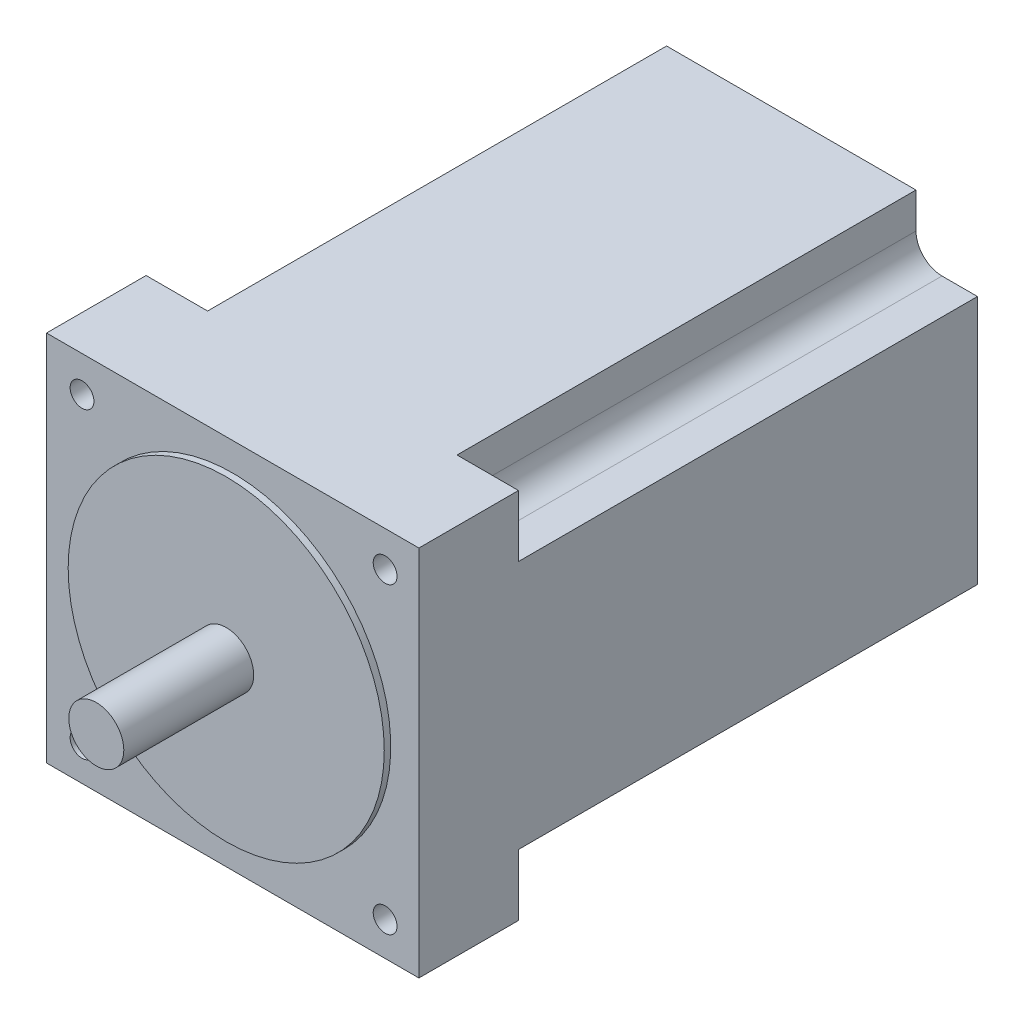
ISO-10303-21;
HEADER;
FILE_DESCRIPTION(('STEP AP214'),'2;1');
FILE_NAME('part.step','',(''),(''),'','','');
FILE_SCHEMA(('AUTOMOTIVE_DESIGN { 1 0 10303 214 1 1 1 1 }'));
ENDSEC;
DATA;
#1=APPLICATION_CONTEXT('core data for automotive mechanical design processes');
#2=APPLICATION_PROTOCOL_DEFINITION('international standard','automotive_design',2000,#1);
#3=PRODUCT_CONTEXT('',#1,'mechanical');
#4=PRODUCT('Part','Part','',(#3));
#5=PRODUCT_RELATED_PRODUCT_CATEGORY('part','',(#4));
#6=PRODUCT_DEFINITION_FORMATION('','',#4);
#7=PRODUCT_DEFINITION_CONTEXT('part definition',#1,'design');
#8=PRODUCT_DEFINITION('design','',#6,#7);
#9=PRODUCT_DEFINITION_SHAPE('','',#8);
#10=(LENGTH_UNIT() NAMED_UNIT(*) SI_UNIT(.MILLI.,.METRE.));
#11=(NAMED_UNIT(*) PLANE_ANGLE_UNIT() SI_UNIT($,.RADIAN.));
#12=(NAMED_UNIT(*) SI_UNIT($,.STERADIAN.) SOLID_ANGLE_UNIT());
#13=UNCERTAINTY_MEASURE_WITH_UNIT(LENGTH_MEASURE(1.E-05),#10,'distance_accuracy_value','');
#14=(GEOMETRIC_REPRESENTATION_CONTEXT(3) GLOBAL_UNCERTAINTY_ASSIGNED_CONTEXT((#13)) GLOBAL_UNIT_ASSIGNED_CONTEXT((#10,
#11,#12)) REPRESENTATION_CONTEXT('',''));
#15=CARTESIAN_POINT('',(0.,0.,0.));
#16=DIRECTION('',(0.,0.,1.));
#17=DIRECTION('',(1.,0.,0.));
#18=AXIS2_PLACEMENT_3D('',#15,#16,#17);
#19=CARTESIAN_POINT('',(0.,0.,66.));
#20=DIRECTION('',(0.,0.,1.));
#21=DIRECTION('',(1.,0.,0.));
#22=AXIS2_PLACEMENT_3D('',#19,#20,#21);
#23=PLANE('',#22);
#24=CARTESIAN_POINT('',(0.,0.,66.));
#25=DIRECTION('',(0.,0.,1.));
#26=DIRECTION('',(1.,0.,0.));
#27=AXIS2_PLACEMENT_3D('',#24,#25,#26);
#28=CIRCLE('',#27,36.5);
#29=CARTESIAN_POINT('',(36.5,0.,66.));
#30=VERTEX_POINT('',#29);
#31=EDGE_CURVE('E704',#30,#30,#28,.T.);
#32=ORIENTED_EDGE('',*,*,#31,.T.);
#33=EDGE_LOOP('',(#32));
#34=FACE_BOUND('',#33,.T.);
#35=CARTESIAN_POINT('',(0.,0.,66.));
#36=DIRECTION('',(0.,0.,1.));
#37=DIRECTION('',(1.,0.,0.));
#38=AXIS2_PLACEMENT_3D('',#35,#36,#37);
#39=CIRCLE('',#38,6.35);
#40=CARTESIAN_POINT('',(6.35,0.,66.));
#41=VERTEX_POINT('',#40);
#42=EDGE_CURVE('E705',#41,#41,#39,.T.);
#43=ORIENTED_EDGE('',*,*,#42,.F.);
#44=EDGE_LOOP('',(#43));
#45=FACE_BOUND('',#44,.T.);
#46=ADVANCED_FACE('F34',(#34,#45),#23,.T.);
#47=CARTESIAN_POINT('',(43.,43.,64.5));
#48=DIRECTION('',(0.,0.,-1.));
#49=DIRECTION('',(-1.,0.,0.));
#50=AXIS2_PLACEMENT_3D('',#47,#48,#49);
#51=PLANE('',#50);
#52=DIRECTION('',(0.,1.,0.));
#53=VECTOR('',#52,1.);
#54=CARTESIAN_POINT('',(43.,-43.,64.5));
#55=LINE('',#54,#53);
#56=CARTESIAN_POINT('',(43.,-43.,64.5));
#57=VERTEX_POINT('',#56);
#58=CARTESIAN_POINT('',(43.,43.,64.5));
#59=VERTEX_POINT('',#58);
#60=EDGE_CURVE('E301',#57,#59,#55,.T.);
#61=ORIENTED_EDGE('',*,*,#60,.T.);
#62=DIRECTION('',(-1.,0.,0.));
#63=VECTOR('',#62,1.);
#64=CARTESIAN_POINT('',(-43.,43.,64.5));
#65=LINE('',#64,#63);
#66=CARTESIAN_POINT('',(-43.,43.,64.5));
#67=VERTEX_POINT('',#66);
#68=EDGE_CURVE('E304',#59,#67,#65,.T.);
#69=ORIENTED_EDGE('',*,*,#68,.T.);
#70=DIRECTION('',(0.,-1.,0.));
#71=VECTOR('',#70,1.);
#72=CARTESIAN_POINT('',(-43.,-43.,64.5));
#73=LINE('',#72,#71);
#74=CARTESIAN_POINT('',(-43.,-43.,64.5));
#75=VERTEX_POINT('',#74);
#76=EDGE_CURVE('E307',#67,#75,#73,.T.);
#77=ORIENTED_EDGE('',*,*,#76,.T.);
#78=DIRECTION('',(1.,0.,0.));
#79=VECTOR('',#78,1.);
#80=CARTESIAN_POINT('',(-43.,-43.,64.5));
#81=LINE('',#80,#79);
#82=EDGE_CURVE('E309',#75,#57,#81,.T.);
#83=ORIENTED_EDGE('',*,*,#82,.T.);
#84=EDGE_LOOP('',(#61,#69,#77,#83));
#85=FACE_BOUND('',#84,.T.);
#86=CARTESIAN_POINT('',(35.2,34.8,64.5));
#87=DIRECTION('',(0.,0.,1.));
#88=DIRECTION('',(1.,0.,0.));
#89=AXIS2_PLACEMENT_3D('',#86,#87,#88);
#90=CIRCLE('',#89,2.75);
#91=CARTESIAN_POINT('',(37.95,34.8,64.5));
#92=VERTEX_POINT('',#91);
#93=EDGE_CURVE('E196',#92,#92,#90,.T.);
#94=ORIENTED_EDGE('',*,*,#93,.F.);
#95=EDGE_LOOP('',(#94));
#96=FACE_BOUND('',#95,.T.);
#97=CARTESIAN_POINT('',(35.2,-35.2,64.5));
#98=DIRECTION('',(0.,0.,1.));
#99=DIRECTION('',(1.,0.,0.));
#100=AXIS2_PLACEMENT_3D('',#97,#98,#99);
#101=CIRCLE('',#100,2.75);
#102=CARTESIAN_POINT('',(37.95,-35.2,64.5));
#103=VERTEX_POINT('',#102);
#104=EDGE_CURVE('E721',#103,#103,#101,.T.);
#105=ORIENTED_EDGE('',*,*,#104,.F.);
#106=EDGE_LOOP('',(#105));
#107=FACE_BOUND('',#106,.T.);
#108=CARTESIAN_POINT('',(-34.8,-35.2,64.5));
#109=DIRECTION('',(0.,0.,1.));
#110=DIRECTION('',(1.,0.,0.));
#111=AXIS2_PLACEMENT_3D('',#108,#109,#110);
#112=CIRCLE('',#111,2.75);
#113=CARTESIAN_POINT('',(-32.05,-35.2,64.5));
#114=VERTEX_POINT('',#113);
#115=EDGE_CURVE('E715',#114,#114,#112,.T.);
#116=ORIENTED_EDGE('',*,*,#115,.F.);
#117=EDGE_LOOP('',(#116));
#118=FACE_BOUND('',#117,.T.);
#119=CARTESIAN_POINT('',(-34.8,34.8,64.5));
#120=DIRECTION('',(0.,0.,1.));
#121=DIRECTION('',(1.,0.,0.));
#122=AXIS2_PLACEMENT_3D('',#119,#120,#121);
#123=CIRCLE('',#122,2.75);
#124=CARTESIAN_POINT('',(-32.05,34.8,64.5));
#125=VERTEX_POINT('',#124);
#126=EDGE_CURVE('E707',#125,#125,#123,.T.);
#127=ORIENTED_EDGE('',*,*,#126,.F.);
#128=EDGE_LOOP('',(#127));
#129=FACE_BOUND('',#128,.T.);
#130=CARTESIAN_POINT('',(0.,0.,64.5));
#131=DIRECTION('',(0.,0.,-1.));
#132=DIRECTION('',(-1.,0.,0.));
#133=AXIS2_PLACEMENT_3D('',#130,#131,#132);
#134=CIRCLE('',#133,36.5);
#135=CARTESIAN_POINT('',(-36.5,0.,64.5));
#136=VERTEX_POINT('',#135);
#137=EDGE_CURVE('E11',#136,#136,#134,.F.);
#138=ORIENTED_EDGE('',*,*,#137,.F.);
#139=EDGE_LOOP('',(#138));
#140=FACE_BOUND('',#139,.T.);
#141=ADVANCED_FACE('F374',(#85,#96,#107,#118,#129,#140),#51,.F.);
#142=CARTESIAN_POINT('',(43.,-43.,64.5));
#143=DIRECTION('',(-1.,0.,0.));
#144=DIRECTION('',(0.,0.,1.));
#145=AXIS2_PLACEMENT_3D('',#142,#143,#144);
#146=PLANE('',#145);
#147=DIRECTION('',(0.,-1.,0.));
#148=VECTOR('',#147,1.);
#149=CARTESIAN_POINT('',(43.0000000000004,-42.9999999999995,41.5));
#150=LINE('',#149,#148);
#151=CARTESIAN_POINT('',(43.0000000000003,-28.7999999999995,41.5));
#152=VERTEX_POINT('',#151);
#153=CARTESIAN_POINT('',(43.0000000000004,-42.9999999999995,41.5));
#154=VERTEX_POINT('',#153);
#155=EDGE_CURVE('E186',#152,#154,#150,.T.);
#156=ORIENTED_EDGE('',*,*,#155,.F.);
#157=DIRECTION('',(0.,0.,-1.));
#158=VECTOR('',#157,1.);
#159=CARTESIAN_POINT('',(43.0000000000003,-28.7999999999995,41.5));
#160=LINE('',#159,#158);
#161=CARTESIAN_POINT('',(43.0000000000003,-28.7999999999995,-64.5));
#162=VERTEX_POINT('',#161);
#163=EDGE_CURVE('E177',#152,#162,#160,.T.);
#164=ORIENTED_EDGE('',*,*,#163,.T.);
#165=DIRECTION('',(0.,1.,0.));
#166=VECTOR('',#165,1.);
#167=CARTESIAN_POINT('',(43.,-43.,-64.5));
#168=LINE('',#167,#166);
#169=CARTESIAN_POINT('',(43.,28.8,-64.5));
#170=VERTEX_POINT('',#169);
#171=EDGE_CURVE('E292',#162,#170,#168,.T.);
#172=ORIENTED_EDGE('',*,*,#171,.T.);
#173=DIRECTION('',(0.,0.,-1.));
#174=VECTOR('',#173,1.);
#175=CARTESIAN_POINT('',(43.,28.8,41.5));
#176=LINE('',#175,#174);
#177=CARTESIAN_POINT('',(43.,28.8,41.5));
#178=VERTEX_POINT('',#177);
#179=EDGE_CURVE('E293',#178,#170,#176,.T.);
#180=ORIENTED_EDGE('',*,*,#179,.F.);
#181=DIRECTION('',(0.,-1.,0.));
#182=VECTOR('',#181,1.);
#183=CARTESIAN_POINT('',(43.,43.,41.5));
#184=LINE('',#183,#182);
#185=CARTESIAN_POINT('',(43.,43.,41.5));
#186=VERTEX_POINT('',#185);
#187=EDGE_CURVE('E279',#186,#178,#184,.T.);
#188=ORIENTED_EDGE('',*,*,#187,.F.);
#189=DIRECTION('',(0.,0.,-1.));
#190=VECTOR('',#189,1.);
#191=CARTESIAN_POINT('',(43.,43.,64.5));
#192=LINE('',#191,#190);
#193=EDGE_CURVE('E42',#59,#186,#192,.T.);
#194=ORIENTED_EDGE('',*,*,#193,.F.);
#195=ORIENTED_EDGE('',*,*,#60,.F.);
#196=DIRECTION('',(0.,0.,-1.));
#197=VECTOR('',#196,1.);
#198=CARTESIAN_POINT('',(43.,-43.,64.5));
#199=LINE('',#198,#197);
#200=EDGE_CURVE('E311',#57,#154,#199,.T.);
#201=ORIENTED_EDGE('',*,*,#200,.T.);
#202=EDGE_LOOP('',(#156,#164,#172,#180,#188,#194,#195,#201));
#203=FACE_BOUND('',#202,.T.);
#204=ADVANCED_FACE('F36',(#203),#146,.F.);
#205=CARTESIAN_POINT('',(-43.,43.,64.5));
#206=DIRECTION('',(0.,-1.,0.));
#207=DIRECTION('',(0.,0.,-1.));
#208=AXIS2_PLACEMENT_3D('',#205,#206,#207);
#209=PLANE('',#208);
#210=DIRECTION('',(-1.,0.,0.));
#211=VECTOR('',#210,1.);
#212=CARTESIAN_POINT('',(-43.,43.,-64.5));
#213=LINE('',#212,#211);
#214=CARTESIAN_POINT('',(28.8,43.,-64.5));
#215=VERTEX_POINT('',#214);
#216=CARTESIAN_POINT('',(-28.8000000000001,42.9999999999999,-64.5));
#217=VERTEX_POINT('',#216);
#218=EDGE_CURVE('E313',#215,#217,#213,.T.);
#219=ORIENTED_EDGE('',*,*,#218,.T.);
#220=DIRECTION('',(0.,0.,-1.));
#221=VECTOR('',#220,1.);
#222=CARTESIAN_POINT('',(-28.8000000000001,42.9999999999999,41.5));
#223=LINE('',#222,#221);
#224=CARTESIAN_POINT('',(-28.8000000000001,42.9999999999999,41.5));
#225=VERTEX_POINT('',#224);
#226=EDGE_CURVE('E263',#225,#217,#223,.T.);
#227=ORIENTED_EDGE('',*,*,#226,.F.);
#228=DIRECTION('',(1.,0.,0.));
#229=VECTOR('',#228,1.);
#230=CARTESIAN_POINT('',(-43.0000000000001,42.9999999999998,41.5));
#231=LINE('',#230,#229);
#232=CARTESIAN_POINT('',(-43.0000000000001,42.9999999999998,41.5));
#233=VERTEX_POINT('',#232);
#234=EDGE_CURVE('E249',#233,#225,#231,.T.);
#235=ORIENTED_EDGE('',*,*,#234,.F.);
#236=DIRECTION('',(0.,0.,-1.));
#237=VECTOR('',#236,1.);
#238=CARTESIAN_POINT('',(-43.,43.,64.5));
#239=LINE('',#238,#237);
#240=EDGE_CURVE('E326',#67,#233,#239,.T.);
#241=ORIENTED_EDGE('',*,*,#240,.F.);
#242=ORIENTED_EDGE('',*,*,#68,.F.);
#243=ORIENTED_EDGE('',*,*,#193,.T.);
#244=DIRECTION('',(1.,0.,0.));
#245=VECTOR('',#244,1.);
#246=CARTESIAN_POINT('',(43.,43.,41.5));
#247=LINE('',#246,#245);
#248=CARTESIAN_POINT('',(28.8,43.,41.5));
#249=VERTEX_POINT('',#248);
#250=EDGE_CURVE('E277',#249,#186,#247,.T.);
#251=ORIENTED_EDGE('',*,*,#250,.F.);
#252=DIRECTION('',(0.,0.,-1.));
#253=VECTOR('',#252,1.);
#254=CARTESIAN_POINT('',(28.8,43.,41.5));
#255=LINE('',#254,#253);
#256=EDGE_CURVE('E296',#249,#215,#255,.T.);
#257=ORIENTED_EDGE('',*,*,#256,.T.);
#258=EDGE_LOOP('',(#219,#227,#235,#241,#242,#243,#251,#257));
#259=FACE_BOUND('',#258,.T.);
#260=ADVANCED_FACE('F332',(#259),#209,.F.);
#261=CARTESIAN_POINT('',(-43.,-43.,64.5));
#262=DIRECTION('',(1.,0.,0.));
#263=DIRECTION('',(0.,0.,-1.));
#264=AXIS2_PLACEMENT_3D('',#261,#262,#263);
#265=PLANE('',#264);
#266=DIRECTION('',(0.,-1.,0.));
#267=VECTOR('',#266,1.);
#268=CARTESIAN_POINT('',(-43.,-43.,-64.5));
#269=LINE('',#268,#267);
#270=CARTESIAN_POINT('',(-43.0000000000001,28.7999999999999,-64.5));
#271=VERTEX_POINT('',#270);
#272=CARTESIAN_POINT('',(-43.,-28.8,-64.5));
#273=VERTEX_POINT('',#272);
#274=EDGE_CURVE('E316',#271,#273,#269,.T.);
#275=ORIENTED_EDGE('',*,*,#274,.T.);
#276=DIRECTION('',(0.,0.,-1.));
#277=VECTOR('',#276,1.);
#278=CARTESIAN_POINT('',(-43.,-28.8,41.5));
#279=LINE('',#278,#277);
#280=CARTESIAN_POINT('',(-43.,-28.8,41.5));
#281=VERTEX_POINT('',#280);
#282=EDGE_CURVE('E234',#281,#273,#279,.T.);
#283=ORIENTED_EDGE('',*,*,#282,.F.);
#284=DIRECTION('',(0.,1.,0.));
#285=VECTOR('',#284,1.);
#286=CARTESIAN_POINT('',(-43.,-43.,41.5));
#287=LINE('',#286,#285);
#288=CARTESIAN_POINT('',(-43.,-43.,41.5));
#289=VERTEX_POINT('',#288);
#290=EDGE_CURVE('E220',#289,#281,#287,.T.);
#291=ORIENTED_EDGE('',*,*,#290,.F.);
#292=DIRECTION('',(0.,0.,-1.));
#293=VECTOR('',#292,1.);
#294=CARTESIAN_POINT('',(-43.,-43.,64.5));
#295=LINE('',#294,#293);
#296=EDGE_CURVE('E323',#75,#289,#295,.T.);
#297=ORIENTED_EDGE('',*,*,#296,.F.);
#298=ORIENTED_EDGE('',*,*,#76,.F.);
#299=ORIENTED_EDGE('',*,*,#240,.T.);
#300=DIRECTION('',(0.,1.,0.));
#301=VECTOR('',#300,1.);
#302=CARTESIAN_POINT('',(-43.0000000000001,42.9999999999998,41.5));
#303=LINE('',#302,#301);
#304=CARTESIAN_POINT('',(-43.0000000000001,28.7999999999999,41.5));
#305=VERTEX_POINT('',#304);
#306=EDGE_CURVE('E247',#305,#233,#303,.T.);
#307=ORIENTED_EDGE('',*,*,#306,.F.);
#308=DIRECTION('',(0.,0.,-1.));
#309=VECTOR('',#308,1.);
#310=CARTESIAN_POINT('',(-43.0000000000001,28.7999999999999,41.5));
#311=LINE('',#310,#309);
#312=EDGE_CURVE('E265',#305,#271,#311,.T.);
#313=ORIENTED_EDGE('',*,*,#312,.T.);
#314=EDGE_LOOP('',(#275,#283,#291,#297,#298,#299,#307,#313));
#315=FACE_BOUND('',#314,.T.);
#316=ADVANCED_FACE('F369',(#315),#265,.F.);
#317=CARTESIAN_POINT('',(-43.,-43.,64.5));
#318=DIRECTION('',(0.,1.,0.));
#319=DIRECTION('',(0.,0.,1.));
#320=AXIS2_PLACEMENT_3D('',#317,#318,#319);
#321=PLANE('',#320);
#322=DIRECTION('',(1.,0.,0.));
#323=VECTOR('',#322,1.);
#324=CARTESIAN_POINT('',(-43.,-43.,-64.5));
#325=LINE('',#324,#323);
#326=CARTESIAN_POINT('',(-28.8,-43.,-64.5));
#327=VERTEX_POINT('',#326);
#328=CARTESIAN_POINT('',(28.8000000000005,-42.9999999999997,-64.5));
#329=VERTEX_POINT('',#328);
#330=EDGE_CURVE('E305',#327,#329,#325,.T.);
#331=ORIENTED_EDGE('',*,*,#330,.T.);
#332=DIRECTION('',(0.,0.,-1.));
#333=VECTOR('',#332,1.);
#334=CARTESIAN_POINT('',(28.8000000000005,-42.9999999999997,41.5));
#335=LINE('',#334,#333);
#336=CARTESIAN_POINT('',(28.8000000000005,-42.9999999999997,41.5));
#337=VERTEX_POINT('',#336);
#338=EDGE_CURVE('E208',#337,#329,#335,.T.);
#339=ORIENTED_EDGE('',*,*,#338,.F.);
#340=DIRECTION('',(-1.,0.,0.));
#341=VECTOR('',#340,1.);
#342=CARTESIAN_POINT('',(43.0000000000004,-42.9999999999995,41.5));
#343=LINE('',#342,#341);
#344=EDGE_CURVE('E200',#154,#337,#343,.T.);
#345=ORIENTED_EDGE('',*,*,#344,.F.);
#346=ORIENTED_EDGE('',*,*,#200,.F.);
#347=ORIENTED_EDGE('',*,*,#82,.F.);
#348=ORIENTED_EDGE('',*,*,#296,.T.);
#349=DIRECTION('',(-1.,0.,0.));
#350=VECTOR('',#349,1.);
#351=CARTESIAN_POINT('',(-43.,-43.,41.5));
#352=LINE('',#351,#350);
#353=CARTESIAN_POINT('',(-28.8,-43.,41.5));
#354=VERTEX_POINT('',#353);
#355=EDGE_CURVE('E218',#354,#289,#352,.T.);
#356=ORIENTED_EDGE('',*,*,#355,.F.);
#357=DIRECTION('',(0.,0.,-1.));
#358=VECTOR('',#357,1.);
#359=CARTESIAN_POINT('',(-28.8,-43.,41.5));
#360=LINE('',#359,#358);
#361=EDGE_CURVE('E236',#354,#327,#360,.T.);
#362=ORIENTED_EDGE('',*,*,#361,.T.);
#363=EDGE_LOOP('',(#331,#339,#345,#346,#347,#348,#356,#362));
#364=FACE_BOUND('',#363,.T.);
#365=ADVANCED_FACE('F379',(#364),#321,.F.);
#366=CARTESIAN_POINT('',(43.,43.,-64.5));
#367=DIRECTION('',(0.,0.,-1.));
#368=DIRECTION('',(-1.,0.,0.));
#369=AXIS2_PLACEMENT_3D('',#366,#367,#368);
#370=PLANE('',#369);
#371=DIRECTION('',(0.,1.,0.));
#372=VECTOR('',#371,1.);
#373=CARTESIAN_POINT('',(28.8000000000004,-34.7999999999997,-64.5));
#374=LINE('',#373,#372);
#375=CARTESIAN_POINT('',(28.8000000000004,-34.7999999999997,-64.5));
#376=VERTEX_POINT('',#375);
#377=EDGE_CURVE('E190',#329,#376,#374,.T.);
#378=ORIENTED_EDGE('',*,*,#377,.F.);
#379=ORIENTED_EDGE('',*,*,#330,.F.);
#380=DIRECTION('',(0.,-1.,0.));
#381=VECTOR('',#380,1.);
#382=CARTESIAN_POINT('',(-28.8,-34.8,-64.5));
#383=LINE('',#382,#381);
#384=CARTESIAN_POINT('',(-28.8,-34.8,-64.5));
#385=VERTEX_POINT('',#384);
#386=EDGE_CURVE('E227',#385,#327,#383,.T.);
#387=ORIENTED_EDGE('',*,*,#386,.F.);
#388=CARTESIAN_POINT('',(-34.8,-34.8,-64.5));
#389=DIRECTION('',(0.,0.,-1.));
#390=DIRECTION('',(-1.,0.,0.));
#391=AXIS2_PLACEMENT_3D('',#388,#389,#390);
#392=CIRCLE('',#391,6.);
#393=CARTESIAN_POINT('',(-34.8,-28.8,-64.5));
#394=VERTEX_POINT('',#393);
#395=EDGE_CURVE('E57',#394,#385,#392,.T.);
#396=ORIENTED_EDGE('',*,*,#395,.F.);
#397=DIRECTION('',(1.,0.,0.));
#398=VECTOR('',#397,1.);
#399=CARTESIAN_POINT('',(-34.8,-28.8,-64.5));
#400=LINE('',#399,#398);
#401=EDGE_CURVE('E215',#273,#394,#400,.T.);
#402=ORIENTED_EDGE('',*,*,#401,.F.);
#403=ORIENTED_EDGE('',*,*,#274,.F.);
#404=DIRECTION('',(-1.,0.,0.));
#405=VECTOR('',#404,1.);
#406=CARTESIAN_POINT('',(-34.8000000000001,28.7999999999999,-64.5));
#407=LINE('',#406,#405);
#408=CARTESIAN_POINT('',(-34.8000000000001,28.7999999999999,-64.5));
#409=VERTEX_POINT('',#408);
#410=EDGE_CURVE('E256',#409,#271,#407,.T.);
#411=ORIENTED_EDGE('',*,*,#410,.F.);
#412=CARTESIAN_POINT('',(-34.8000000000001,34.7999999999999,-64.5));
#413=DIRECTION('',(0.,0.,-1.));
#414=DIRECTION('',(0.,1.,0.));
#415=AXIS2_PLACEMENT_3D('',#412,#413,#414);
#416=CIRCLE('',#415,6.);
#417=CARTESIAN_POINT('',(-28.8000000000001,34.7999999999999,-64.5));
#418=VERTEX_POINT('',#417);
#419=EDGE_CURVE('E233',#418,#409,#416,.T.);
#420=ORIENTED_EDGE('',*,*,#419,.F.);
#421=DIRECTION('',(0.,-1.,0.));
#422=VECTOR('',#421,1.);
#423=CARTESIAN_POINT('',(-28.8000000000001,34.7999999999999,-64.5));
#424=LINE('',#423,#422);
#425=EDGE_CURVE('E244',#217,#418,#424,.T.);
#426=ORIENTED_EDGE('',*,*,#425,.F.);
#427=ORIENTED_EDGE('',*,*,#218,.F.);
#428=DIRECTION('',(0.,1.,0.));
#429=VECTOR('',#428,1.);
#430=CARTESIAN_POINT('',(28.8,34.8,-64.5));
#431=LINE('',#430,#429);
#432=CARTESIAN_POINT('',(28.8,34.8,-64.5));
#433=VERTEX_POINT('',#432);
#434=EDGE_CURVE('E286',#433,#215,#431,.T.);
#435=ORIENTED_EDGE('',*,*,#434,.F.);
#436=CARTESIAN_POINT('',(34.8,34.8,-64.5));
#437=DIRECTION('',(0.,0.,-1.));
#438=DIRECTION('',(1.,0.,0.));
#439=AXIS2_PLACEMENT_3D('',#436,#437,#438);
#440=CIRCLE('',#439,6.);
#441=CARTESIAN_POINT('',(34.8,28.8,-64.5));
#442=VERTEX_POINT('',#441);
#443=EDGE_CURVE('E262',#442,#433,#440,.T.);
#444=ORIENTED_EDGE('',*,*,#443,.F.);
#445=DIRECTION('',(-1.,0.,0.));
#446=VECTOR('',#445,1.);
#447=CARTESIAN_POINT('',(34.8,28.8,-64.5));
#448=LINE('',#447,#446);
#449=EDGE_CURVE('E274',#170,#442,#448,.T.);
#450=ORIENTED_EDGE('',*,*,#449,.F.);
#451=ORIENTED_EDGE('',*,*,#171,.F.);
#452=DIRECTION('',(1.,0.,0.));
#453=VECTOR('',#452,1.);
#454=CARTESIAN_POINT('',(34.8000000000003,-28.7999999999996,-64.5));
#455=LINE('',#454,#453);
#456=CARTESIAN_POINT('',(34.8000000000003,-28.7999999999996,-64.5));
#457=VERTEX_POINT('',#456);
#458=EDGE_CURVE('E193',#457,#162,#455,.T.);
#459=ORIENTED_EDGE('',*,*,#458,.F.);
#460=CARTESIAN_POINT('',(34.8000000000004,-34.7999999999996,-64.5));
#461=DIRECTION('',(0.,0.,-1.));
#462=DIRECTION('',(0.,-1.,0.));
#463=AXIS2_PLACEMENT_3D('',#460,#461,#462);
#464=CIRCLE('',#463,6.);
#465=EDGE_CURVE('E49',#376,#457,#464,.T.);
#466=ORIENTED_EDGE('',*,*,#465,.F.);
#467=EDGE_LOOP('',(#378,#379,#387,#396,#402,#403,#411,#420,#426,#427,#435,#444,#450,#451,#459,#466));
#468=FACE_BOUND('',#467,.T.);
#469=ADVANCED_FACE('F357',(#468),#370,.T.);
#470=CARTESIAN_POINT('',(34.8,34.8,41.5));
#471=DIRECTION('',(0.,0.,-1.));
#472=DIRECTION('',(-1.,0.,0.));
#473=AXIS2_PLACEMENT_3D('',#470,#471,#472);
#474=CYLINDRICAL_SURFACE('',#473,6.);
#475=ORIENTED_EDGE('',*,*,#443,.T.);
#476=DIRECTION('',(0.,0.,-1.));
#477=VECTOR('',#476,1.);
#478=CARTESIAN_POINT('',(28.8,34.8,41.5));
#479=LINE('',#478,#477);
#480=CARTESIAN_POINT('',(28.8,34.8,41.5));
#481=VERTEX_POINT('',#480);
#482=EDGE_CURVE('E284',#481,#433,#479,.T.);
#483=ORIENTED_EDGE('',*,*,#482,.F.);
#484=CARTESIAN_POINT('',(34.8,34.8,41.5));
#485=DIRECTION('',(0.,0.,-1.));
#486=DIRECTION('',(1.,0.,0.));
#487=AXIS2_PLACEMENT_3D('',#484,#485,#486);
#488=CIRCLE('',#487,6.);
#489=CARTESIAN_POINT('',(34.8,28.8,41.5));
#490=VERTEX_POINT('',#489);
#491=EDGE_CURVE('E270',#490,#481,#488,.T.);
#492=ORIENTED_EDGE('',*,*,#491,.F.);
#493=DIRECTION('',(0.,0.,-1.));
#494=VECTOR('',#493,1.);
#495=CARTESIAN_POINT('',(34.8,28.8,41.5));
#496=LINE('',#495,#494);
#497=EDGE_CURVE('E290',#490,#442,#496,.T.);
#498=ORIENTED_EDGE('',*,*,#497,.T.);
#499=EDGE_LOOP('',(#475,#483,#492,#498));
#500=FACE_BOUND('',#499,.T.);
#501=ADVANCED_FACE('F347',(#500),#474,.F.);
#502=CARTESIAN_POINT('',(34.8,28.8,41.5));
#503=DIRECTION('',(0.,-1.,0.));
#504=DIRECTION('',(0.,0.,-1.));
#505=AXIS2_PLACEMENT_3D('',#502,#503,#504);
#506=PLANE('',#505);
#507=ORIENTED_EDGE('',*,*,#449,.T.);
#508=ORIENTED_EDGE('',*,*,#497,.F.);
#509=DIRECTION('',(-1.,0.,0.));
#510=VECTOR('',#509,1.);
#511=CARTESIAN_POINT('',(34.8,28.8,41.5));
#512=LINE('',#511,#510);
#513=EDGE_CURVE('E281',#178,#490,#512,.T.);
#514=ORIENTED_EDGE('',*,*,#513,.F.);
#515=ORIENTED_EDGE('',*,*,#179,.T.);
#516=EDGE_LOOP('',(#507,#508,#514,#515));
#517=FACE_BOUND('',#516,.T.);
#518=ADVANCED_FACE('F342',(#517),#506,.F.);
#519=CARTESIAN_POINT('',(28.8,34.8,41.5));
#520=DIRECTION('',(-1.,0.,0.));
#521=DIRECTION('',(0.,0.,1.));
#522=AXIS2_PLACEMENT_3D('',#519,#520,#521);
#523=PLANE('',#522);
#524=ORIENTED_EDGE('',*,*,#434,.T.);
#525=ORIENTED_EDGE('',*,*,#256,.F.);
#526=DIRECTION('',(0.,1.,0.));
#527=VECTOR('',#526,1.);
#528=CARTESIAN_POINT('',(28.8,34.8,41.5));
#529=LINE('',#528,#527);
#530=EDGE_CURVE('E273',#481,#249,#529,.T.);
#531=ORIENTED_EDGE('',*,*,#530,.F.);
#532=ORIENTED_EDGE('',*,*,#482,.T.);
#533=EDGE_LOOP('',(#524,#525,#531,#532));
#534=FACE_BOUND('',#533,.T.);
#535=ADVANCED_FACE('F350',(#534),#523,.F.);
#536=CARTESIAN_POINT('',(34.8,34.8,41.5));
#537=DIRECTION('',(0.,0.,1.));
#538=DIRECTION('',(1.,0.,0.));
#539=AXIS2_PLACEMENT_3D('',#536,#537,#538);
#540=PLANE('',#539);
#541=ORIENTED_EDGE('',*,*,#491,.T.);
#542=ORIENTED_EDGE('',*,*,#530,.T.);
#543=ORIENTED_EDGE('',*,*,#250,.T.);
#544=ORIENTED_EDGE('',*,*,#187,.T.);
#545=ORIENTED_EDGE('',*,*,#513,.T.);
#546=EDGE_LOOP('',(#541,#542,#543,#544,#545));
#547=FACE_BOUND('',#546,.T.);
#548=ADVANCED_FACE('F340',(#547),#540,.F.);
#549=CARTESIAN_POINT('',(-34.8000000000001,34.7999999999999,41.5));
#550=DIRECTION('',(0.,0.,-1.));
#551=DIRECTION('',(-1.,0.,0.));
#552=AXIS2_PLACEMENT_3D('',#549,#550,#551);
#553=CYLINDRICAL_SURFACE('',#552,6.);
#554=ORIENTED_EDGE('',*,*,#419,.T.);
#555=DIRECTION('',(0.,0.,-1.));
#556=VECTOR('',#555,1.);
#557=CARTESIAN_POINT('',(-34.8000000000001,28.7999999999999,41.5));
#558=LINE('',#557,#556);
#559=CARTESIAN_POINT('',(-34.8000000000001,28.7999999999999,41.5));
#560=VERTEX_POINT('',#559);
#561=EDGE_CURVE('E254',#560,#409,#558,.T.);
#562=ORIENTED_EDGE('',*,*,#561,.F.);
#563=CARTESIAN_POINT('',(-34.8000000000001,34.7999999999999,41.5));
#564=DIRECTION('',(0.,0.,-1.));
#565=DIRECTION('',(0.,1.,0.));
#566=AXIS2_PLACEMENT_3D('',#563,#564,#565);
#567=CIRCLE('',#566,6.);
#568=CARTESIAN_POINT('',(-28.8000000000001,34.7999999999999,41.5));
#569=VERTEX_POINT('',#568);
#570=EDGE_CURVE('E240',#569,#560,#567,.T.);
#571=ORIENTED_EDGE('',*,*,#570,.F.);
#572=DIRECTION('',(0.,0.,-1.));
#573=VECTOR('',#572,1.);
#574=CARTESIAN_POINT('',(-28.8000000000001,34.7999999999999,41.5));
#575=LINE('',#574,#573);
#576=EDGE_CURVE('E260',#569,#418,#575,.T.);
#577=ORIENTED_EDGE('',*,*,#576,.T.);
#578=EDGE_LOOP('',(#554,#562,#571,#577));
#579=FACE_BOUND('',#578,.T.);
#580=ADVANCED_FACE('F404',(#579),#553,.F.);
#581=CARTESIAN_POINT('',(-28.8000000000001,34.7999999999999,41.5));
#582=DIRECTION('',(1.,0.,0.));
#583=DIRECTION('',(0.,1.,0.));
#584=AXIS2_PLACEMENT_3D('',#581,#582,#583);
#585=PLANE('',#584);
#586=ORIENTED_EDGE('',*,*,#425,.T.);
#587=ORIENTED_EDGE('',*,*,#576,.F.);
#588=DIRECTION('',(0.,-1.,0.));
#589=VECTOR('',#588,1.);
#590=CARTESIAN_POINT('',(-28.8000000000001,34.7999999999999,41.5));
#591=LINE('',#590,#589);
#592=EDGE_CURVE('E251',#225,#569,#591,.T.);
#593=ORIENTED_EDGE('',*,*,#592,.F.);
#594=ORIENTED_EDGE('',*,*,#226,.T.);
#595=EDGE_LOOP('',(#586,#587,#593,#594));
#596=FACE_BOUND('',#595,.T.);
#597=ADVANCED_FACE('F361',(#596),#585,.F.);
#598=CARTESIAN_POINT('',(-34.8000000000001,28.7999999999999,41.5));
#599=DIRECTION('',(0.,-1.,0.));
#600=DIRECTION('',(1.,0.,0.));
#601=AXIS2_PLACEMENT_3D('',#598,#599,#600);
#602=PLANE('',#601);
#603=ORIENTED_EDGE('',*,*,#410,.T.);
#604=ORIENTED_EDGE('',*,*,#312,.F.);
#605=DIRECTION('',(-1.,0.,0.));
#606=VECTOR('',#605,1.);
#607=CARTESIAN_POINT('',(-34.8000000000001,28.7999999999999,41.5));
#608=LINE('',#607,#606);
#609=EDGE_CURVE('E243',#560,#305,#608,.T.);
#610=ORIENTED_EDGE('',*,*,#609,.F.);
#611=ORIENTED_EDGE('',*,*,#561,.T.);
#612=EDGE_LOOP('',(#603,#604,#610,#611));
#613=FACE_BOUND('',#612,.T.);
#614=ADVANCED_FACE('F401',(#613),#602,.F.);
#615=CARTESIAN_POINT('',(-34.8000000000001,34.7999999999999,41.5));
#616=DIRECTION('',(0.,0.,1.));
#617=DIRECTION('',(0.,1.,0.));
#618=AXIS2_PLACEMENT_3D('',#615,#616,#617);
#619=PLANE('',#618);
#620=ORIENTED_EDGE('',*,*,#570,.T.);
#621=ORIENTED_EDGE('',*,*,#609,.T.);
#622=ORIENTED_EDGE('',*,*,#306,.T.);
#623=ORIENTED_EDGE('',*,*,#234,.T.);
#624=ORIENTED_EDGE('',*,*,#592,.T.);
#625=EDGE_LOOP('',(#620,#621,#622,#623,#624));
#626=FACE_BOUND('',#625,.T.);
#627=ADVANCED_FACE('F405',(#626),#619,.F.);
#628=CARTESIAN_POINT('',(-34.8,-34.8,41.5));
#629=DIRECTION('',(0.,0.,-1.));
#630=DIRECTION('',(-1.,0.,0.));
#631=AXIS2_PLACEMENT_3D('',#628,#629,#630);
#632=CYLINDRICAL_SURFACE('',#631,6.);
#633=ORIENTED_EDGE('',*,*,#395,.T.);
#634=DIRECTION('',(0.,0.,-1.));
#635=VECTOR('',#634,1.);
#636=CARTESIAN_POINT('',(-28.8,-34.8,41.5));
#637=LINE('',#636,#635);
#638=CARTESIAN_POINT('',(-28.8,-34.8,41.5));
#639=VERTEX_POINT('',#638);
#640=EDGE_CURVE('E225',#639,#385,#637,.T.);
#641=ORIENTED_EDGE('',*,*,#640,.F.);
#642=CARTESIAN_POINT('',(-34.8,-34.8,41.5));
#643=DIRECTION('',(0.,0.,-1.));
#644=DIRECTION('',(-1.,0.,0.));
#645=AXIS2_PLACEMENT_3D('',#642,#643,#644);
#646=CIRCLE('',#645,6.);
#647=CARTESIAN_POINT('',(-34.8,-28.8,41.5));
#648=VERTEX_POINT('',#647);
#649=EDGE_CURVE('E211',#648,#639,#646,.T.);
#650=ORIENTED_EDGE('',*,*,#649,.F.);
#651=DIRECTION('',(0.,0.,-1.));
#652=VECTOR('',#651,1.);
#653=CARTESIAN_POINT('',(-34.8,-28.8,41.5));
#654=LINE('',#653,#652);
#655=EDGE_CURVE('E231',#648,#394,#654,.T.);
#656=ORIENTED_EDGE('',*,*,#655,.T.);
#657=EDGE_LOOP('',(#633,#641,#650,#656));
#658=FACE_BOUND('',#657,.T.);
#659=ADVANCED_FACE('F392',(#658),#632,.F.);
#660=CARTESIAN_POINT('',(-34.8,-28.8,41.5));
#661=DIRECTION('',(0.,1.,0.));
#662=DIRECTION('',(0.,0.,1.));
#663=AXIS2_PLACEMENT_3D('',#660,#661,#662);
#664=PLANE('',#663);
#665=ORIENTED_EDGE('',*,*,#401,.T.);
#666=ORIENTED_EDGE('',*,*,#655,.F.);
#667=DIRECTION('',(1.,0.,0.));
#668=VECTOR('',#667,1.);
#669=CARTESIAN_POINT('',(-34.8,-28.8,41.5));
#670=LINE('',#669,#668);
#671=EDGE_CURVE('E222',#281,#648,#670,.T.);
#672=ORIENTED_EDGE('',*,*,#671,.F.);
#673=ORIENTED_EDGE('',*,*,#282,.T.);
#674=EDGE_LOOP('',(#665,#666,#672,#673));
#675=FACE_BOUND('',#674,.T.);
#676=ADVANCED_FACE('F398',(#675),#664,.F.);
#677=CARTESIAN_POINT('',(-28.8,-34.8,41.5));
#678=DIRECTION('',(1.,0.,0.));
#679=DIRECTION('',(0.,0.,-1.));
#680=AXIS2_PLACEMENT_3D('',#677,#678,#679);
#681=PLANE('',#680);
#682=ORIENTED_EDGE('',*,*,#386,.T.);
#683=ORIENTED_EDGE('',*,*,#361,.F.);
#684=DIRECTION('',(0.,-1.,0.));
#685=VECTOR('',#684,1.);
#686=CARTESIAN_POINT('',(-28.8,-34.8,41.5));
#687=LINE('',#686,#685);
#688=EDGE_CURVE('E214',#639,#354,#687,.T.);
#689=ORIENTED_EDGE('',*,*,#688,.F.);
#690=ORIENTED_EDGE('',*,*,#640,.T.);
#691=EDGE_LOOP('',(#682,#683,#689,#690));
#692=FACE_BOUND('',#691,.T.);
#693=ADVANCED_FACE('F389',(#692),#681,.F.);
#694=CARTESIAN_POINT('',(-34.8,-34.8,41.5));
#695=DIRECTION('',(0.,0.,1.));
#696=DIRECTION('',(-1.,0.,0.));
#697=AXIS2_PLACEMENT_3D('',#694,#695,#696);
#698=PLANE('',#697);
#699=ORIENTED_EDGE('',*,*,#649,.T.);
#700=ORIENTED_EDGE('',*,*,#688,.T.);
#701=ORIENTED_EDGE('',*,*,#355,.T.);
#702=ORIENTED_EDGE('',*,*,#290,.T.);
#703=ORIENTED_EDGE('',*,*,#671,.T.);
#704=EDGE_LOOP('',(#699,#700,#701,#702,#703));
#705=FACE_BOUND('',#704,.T.);
#706=ADVANCED_FACE('F395',(#705),#698,.F.);
#707=CARTESIAN_POINT('',(34.8000000000004,-34.7999999999996,41.5));
#708=DIRECTION('',(0.,0.,-1.));
#709=DIRECTION('',(-1.,0.,0.));
#710=AXIS2_PLACEMENT_3D('',#707,#708,#709);
#711=CYLINDRICAL_SURFACE('',#710,6.);
#712=ORIENTED_EDGE('',*,*,#465,.T.);
#713=DIRECTION('',(0.,0.,-1.));
#714=VECTOR('',#713,1.);
#715=CARTESIAN_POINT('',(34.8000000000003,-28.7999999999996,41.5));
#716=LINE('',#715,#714);
#717=CARTESIAN_POINT('',(34.8000000000003,-28.7999999999996,41.5));
#718=VERTEX_POINT('',#717);
#719=EDGE_CURVE('E169',#718,#457,#716,.T.);
#720=ORIENTED_EDGE('',*,*,#719,.F.);
#721=CARTESIAN_POINT('',(34.8000000000004,-34.7999999999996,41.5));
#722=DIRECTION('',(0.,0.,-1.));
#723=DIRECTION('',(0.,-1.,0.));
#724=AXIS2_PLACEMENT_3D('',#721,#722,#723);
#725=CIRCLE('',#724,6.);
#726=CARTESIAN_POINT('',(28.8000000000004,-34.7999999999997,41.5));
#727=VERTEX_POINT('',#726);
#728=EDGE_CURVE('E173',#727,#718,#725,.T.);
#729=ORIENTED_EDGE('',*,*,#728,.F.);
#730=DIRECTION('',(0.,0.,-1.));
#731=VECTOR('',#730,1.);
#732=CARTESIAN_POINT('',(28.8000000000004,-34.7999999999997,41.5));
#733=LINE('',#732,#731);
#734=EDGE_CURVE('E206',#727,#376,#733,.T.);
#735=ORIENTED_EDGE('',*,*,#734,.T.);
#736=EDGE_LOOP('',(#712,#720,#729,#735));
#737=FACE_BOUND('',#736,.T.);
#738=ADVANCED_FACE('F171',(#737),#711,.F.);
#739=CARTESIAN_POINT('',(28.8000000000004,-34.7999999999997,41.5));
#740=DIRECTION('',(-1.,0.,0.));
#741=DIRECTION('',(0.,-1.,0.));
#742=AXIS2_PLACEMENT_3D('',#739,#740,#741);
#743=PLANE('',#742);
#744=ORIENTED_EDGE('',*,*,#377,.T.);
#745=ORIENTED_EDGE('',*,*,#734,.F.);
#746=DIRECTION('',(0.,1.,0.));
#747=VECTOR('',#746,1.);
#748=CARTESIAN_POINT('',(28.8000000000004,-34.7999999999997,41.5));
#749=LINE('',#748,#747);
#750=EDGE_CURVE('E178',#337,#727,#749,.T.);
#751=ORIENTED_EDGE('',*,*,#750,.F.);
#752=ORIENTED_EDGE('',*,*,#338,.T.);
#753=EDGE_LOOP('',(#744,#745,#751,#752));
#754=FACE_BOUND('',#753,.T.);
#755=ADVANCED_FACE('F383',(#754),#743,.F.);
#756=CARTESIAN_POINT('',(34.8000000000003,-28.7999999999996,41.5));
#757=DIRECTION('',(0.,1.,0.));
#758=DIRECTION('',(-1.,0.,0.));
#759=AXIS2_PLACEMENT_3D('',#756,#757,#758);
#760=PLANE('',#759);
#761=ORIENTED_EDGE('',*,*,#458,.T.);
#762=ORIENTED_EDGE('',*,*,#163,.F.);
#763=DIRECTION('',(1.,0.,0.));
#764=VECTOR('',#763,1.);
#765=CARTESIAN_POINT('',(34.8000000000003,-28.7999999999996,41.5));
#766=LINE('',#765,#764);
#767=EDGE_CURVE('E181',#718,#152,#766,.T.);
#768=ORIENTED_EDGE('',*,*,#767,.F.);
#769=ORIENTED_EDGE('',*,*,#719,.T.);
#770=EDGE_LOOP('',(#761,#762,#768,#769));
#771=FACE_BOUND('',#770,.T.);
#772=ADVANCED_FACE('F182',(#771),#760,.F.);
#773=CARTESIAN_POINT('',(34.8000000000004,-34.7999999999996,41.5));
#774=DIRECTION('',(0.,0.,1.));
#775=DIRECTION('',(0.,-1.,0.));
#776=AXIS2_PLACEMENT_3D('',#773,#774,#775);
#777=PLANE('',#776);
#778=ORIENTED_EDGE('',*,*,#728,.T.);
#779=ORIENTED_EDGE('',*,*,#767,.T.);
#780=ORIENTED_EDGE('',*,*,#155,.T.);
#781=ORIENTED_EDGE('',*,*,#344,.T.);
#782=ORIENTED_EDGE('',*,*,#750,.T.);
#783=EDGE_LOOP('',(#778,#779,#780,#781,#782));
#784=FACE_BOUND('',#783,.T.);
#785=ADVANCED_FACE('F188',(#784),#777,.F.);
#786=CARTESIAN_POINT('',(35.2,34.8,54.5));
#787=DIRECTION('',(0.,0.,1.));
#788=DIRECTION('',(1.,0.,0.));
#789=AXIS2_PLACEMENT_3D('',#786,#787,#788);
#790=CYLINDRICAL_SURFACE('',#789,2.75);
#791=CARTESIAN_POINT('',(35.2,34.8,54.5));
#792=DIRECTION('',(0.,0.,1.));
#793=DIRECTION('',(1.,0.,0.));
#794=AXIS2_PLACEMENT_3D('',#791,#792,#793);
#795=CIRCLE('',#794,2.75);
#796=CARTESIAN_POINT('',(37.95,34.8,54.5));
#797=VERTEX_POINT('',#796);
#798=EDGE_CURVE('E204',#797,#797,#795,.T.);
#799=ORIENTED_EDGE('',*,*,#798,.F.);
#800=EDGE_LOOP('',(#799));
#801=FACE_BOUND('',#800,.T.);
#802=ORIENTED_EDGE('',*,*,#93,.T.);
#803=EDGE_LOOP('',(#802));
#804=FACE_BOUND('',#803,.T.);
#805=ADVANCED_FACE('F459',(#801,#804),#790,.F.);
#806=CARTESIAN_POINT('',(35.2,34.8,54.5));
#807=DIRECTION('',(0.,0.,1.));
#808=DIRECTION('',(1.,0.,0.));
#809=AXIS2_PLACEMENT_3D('',#806,#807,#808);
#810=PLANE('',#809);
#811=ORIENTED_EDGE('',*,*,#798,.T.);
#812=EDGE_LOOP('',(#811));
#813=FACE_BOUND('',#812,.T.);
#814=ADVANCED_FACE('F455',(#813),#810,.T.);
#815=CARTESIAN_POINT('',(35.2,-35.2,54.5));
#816=DIRECTION('',(0.,0.,1.));
#817=DIRECTION('',(1.,0.,0.));
#818=AXIS2_PLACEMENT_3D('',#815,#816,#817);
#819=CYLINDRICAL_SURFACE('',#818,2.75);
#820=CARTESIAN_POINT('',(35.2,-35.2,54.5));
#821=DIRECTION('',(0.,0.,1.));
#822=DIRECTION('',(1.,0.,0.));
#823=AXIS2_PLACEMENT_3D('',#820,#821,#822);
#824=CIRCLE('',#823,2.75);
#825=CARTESIAN_POINT('',(37.95,-35.2,54.5));
#826=VERTEX_POINT('',#825);
#827=EDGE_CURVE('E724',#826,#826,#824,.T.);
#828=ORIENTED_EDGE('',*,*,#827,.F.);
#829=EDGE_LOOP('',(#828));
#830=FACE_BOUND('',#829,.T.);
#831=ORIENTED_EDGE('',*,*,#104,.T.);
#832=EDGE_LOOP('',(#831));
#833=FACE_BOUND('',#832,.T.);
#834=ADVANCED_FACE('F451',(#830,#833),#819,.F.);
#835=CARTESIAN_POINT('',(35.2,-35.2,54.5));
#836=DIRECTION('',(0.,0.,1.));
#837=DIRECTION('',(1.,0.,0.));
#838=AXIS2_PLACEMENT_3D('',#835,#836,#837);
#839=PLANE('',#838);
#840=ORIENTED_EDGE('',*,*,#827,.T.);
#841=EDGE_LOOP('',(#840));
#842=FACE_BOUND('',#841,.T.);
#843=ADVANCED_FACE('F447',(#842),#839,.T.);
#844=CARTESIAN_POINT('',(-34.8,-35.2,54.5));
#845=DIRECTION('',(0.,0.,1.));
#846=DIRECTION('',(1.,0.,0.));
#847=AXIS2_PLACEMENT_3D('',#844,#845,#846);
#848=CYLINDRICAL_SURFACE('',#847,2.75);
#849=CARTESIAN_POINT('',(-34.8,-35.2,54.5));
#850=DIRECTION('',(0.,0.,1.));
#851=DIRECTION('',(1.,0.,0.));
#852=AXIS2_PLACEMENT_3D('',#849,#850,#851);
#853=CIRCLE('',#852,2.75);
#854=CARTESIAN_POINT('',(-32.05,-35.2,54.5));
#855=VERTEX_POINT('',#854);
#856=EDGE_CURVE('E718',#855,#855,#853,.T.);
#857=ORIENTED_EDGE('',*,*,#856,.F.);
#858=EDGE_LOOP('',(#857));
#859=FACE_BOUND('',#858,.T.);
#860=ORIENTED_EDGE('',*,*,#115,.T.);
#861=EDGE_LOOP('',(#860));
#862=FACE_BOUND('',#861,.T.);
#863=ADVANCED_FACE('F443',(#859,#862),#848,.F.);
#864=CARTESIAN_POINT('',(-34.8,-35.2,54.5));
#865=DIRECTION('',(0.,0.,1.));
#866=DIRECTION('',(1.,0.,0.));
#867=AXIS2_PLACEMENT_3D('',#864,#865,#866);
#868=PLANE('',#867);
#869=ORIENTED_EDGE('',*,*,#856,.T.);
#870=EDGE_LOOP('',(#869));
#871=FACE_BOUND('',#870,.T.);
#872=ADVANCED_FACE('F439',(#871),#868,.T.);
#873=CARTESIAN_POINT('',(-34.8,34.8,54.5));
#874=DIRECTION('',(0.,0.,1.));
#875=DIRECTION('',(1.,0.,0.));
#876=AXIS2_PLACEMENT_3D('',#873,#874,#875);
#877=CYLINDRICAL_SURFACE('',#876,2.75);
#878=CARTESIAN_POINT('',(-34.8,34.8,54.5));
#879=DIRECTION('',(0.,0.,1.));
#880=DIRECTION('',(1.,0.,0.));
#881=AXIS2_PLACEMENT_3D('',#878,#879,#880);
#882=CIRCLE('',#881,2.75);
#883=CARTESIAN_POINT('',(-32.05,34.8,54.5));
#884=VERTEX_POINT('',#883);
#885=EDGE_CURVE('E712',#884,#884,#882,.T.);
#886=ORIENTED_EDGE('',*,*,#885,.F.);
#887=EDGE_LOOP('',(#886));
#888=FACE_BOUND('',#887,.T.);
#889=ORIENTED_EDGE('',*,*,#126,.T.);
#890=EDGE_LOOP('',(#889));
#891=FACE_BOUND('',#890,.T.);
#892=ADVANCED_FACE('F435',(#888,#891),#877,.F.);
#893=CARTESIAN_POINT('',(-34.8,34.8,54.5));
#894=DIRECTION('',(0.,0.,1.));
#895=DIRECTION('',(1.,0.,0.));
#896=AXIS2_PLACEMENT_3D('',#893,#894,#895);
#897=PLANE('',#896);
#898=ORIENTED_EDGE('',*,*,#885,.T.);
#899=EDGE_LOOP('',(#898));
#900=FACE_BOUND('',#899,.T.);
#901=ADVANCED_FACE('F431',(#900),#897,.T.);
#902=CARTESIAN_POINT('',(0.,0.,66.));
#903=DIRECTION('',(0.,0.,-1.));
#904=DIRECTION('',(-1.,0.,0.));
#905=AXIS2_PLACEMENT_3D('',#902,#903,#904);
#906=CYLINDRICAL_SURFACE('',#905,36.5);
#907=ORIENTED_EDGE('',*,*,#31,.F.);
#908=EDGE_LOOP('',(#907));
#909=FACE_BOUND('',#908,.T.);
#910=ORIENTED_EDGE('',*,*,#137,.T.);
#911=EDGE_LOOP('',(#910));
#912=FACE_BOUND('',#911,.T.);
#913=ADVANCED_FACE('F428',(#909,#912),#906,.T.);
#914=CARTESIAN_POINT('',(0.,0.,96.));
#915=DIRECTION('',(0.,0.,-1.));
#916=DIRECTION('',(-1.,0.,0.));
#917=AXIS2_PLACEMENT_3D('',#914,#915,#916);
#918=CYLINDRICAL_SURFACE('',#917,6.35);
#919=CARTESIAN_POINT('',(0.,0.,96.));
#920=DIRECTION('',(0.,0.,1.));
#921=DIRECTION('',(1.,0.,0.));
#922=AXIS2_PLACEMENT_3D('',#919,#920,#921);
#923=CIRCLE('',#922,6.35);
#924=CARTESIAN_POINT('',(6.35,0.,96.));
#925=VERTEX_POINT('',#924);
#926=EDGE_CURVE('E703',#925,#925,#923,.T.);
#927=ORIENTED_EDGE('',*,*,#926,.F.);
#928=EDGE_LOOP('',(#927));
#929=FACE_BOUND('',#928,.T.);
#930=ORIENTED_EDGE('',*,*,#42,.T.);
#931=EDGE_LOOP('',(#930));
#932=FACE_BOUND('',#931,.T.);
#933=ADVANCED_FACE('F426',(#929,#932),#918,.T.);
#934=CARTESIAN_POINT('',(0.,0.,96.));
#935=DIRECTION('',(0.,0.,1.));
#936=DIRECTION('',(1.,0.,0.));
#937=AXIS2_PLACEMENT_3D('',#934,#935,#936);
#938=PLANE('',#937);
#939=ORIENTED_EDGE('',*,*,#926,.T.);
#940=EDGE_LOOP('',(#939));
#941=FACE_BOUND('',#940,.T.);
#942=ADVANCED_FACE('F544',(#941),#938,.T.);
#943=CLOSED_SHELL('',(#46,#141,#204,#260,#316,#365,#469,#501,#518,#535,#548,#580,#597,#614,#627,
#659,#676,#693,#706,#738,#755,#772,#785,#805,#814,#834,#843,#863,#872,#892,#901,#913,#933,#942));
#944=MANIFOLD_SOLID_BREP('B2',#943);
#945=ADVANCED_BREP_SHAPE_REPRESENTATION('',(#18,#944),#14);
#946=SHAPE_DEFINITION_REPRESENTATION(#9,#945);
ENDSEC;
END-ISO-10303-21;
